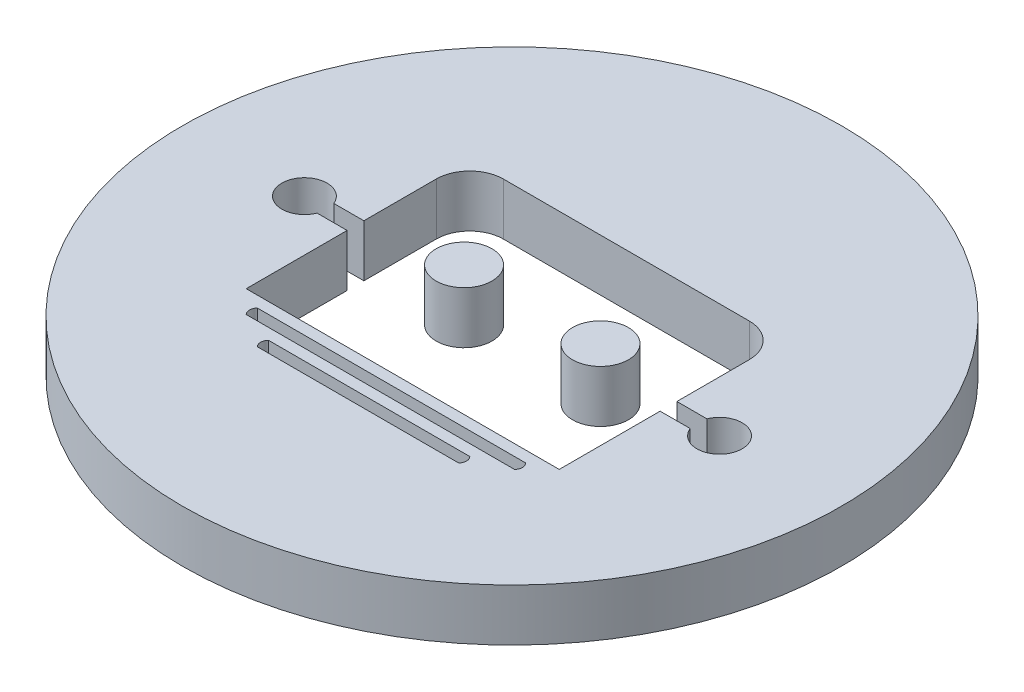
ISO-10303-21;
HEADER;
FILE_DESCRIPTION(('STEP AP214'),'2;1');
FILE_NAME('part.step','',(''),(''),'','','');
FILE_SCHEMA(('AUTOMOTIVE_DESIGN { 1 0 10303 214 1 1 1 1 }'));
ENDSEC;
DATA;
#1=APPLICATION_CONTEXT('core data for automotive mechanical design processes');
#2=APPLICATION_PROTOCOL_DEFINITION('international standard','automotive_design',2000,#1);
#3=PRODUCT_CONTEXT('',#1,'mechanical');
#4=PRODUCT('Part','Part','',(#3));
#5=PRODUCT_RELATED_PRODUCT_CATEGORY('part','',(#4));
#6=PRODUCT_DEFINITION_FORMATION('','',#4);
#7=PRODUCT_DEFINITION_CONTEXT('part definition',#1,'design');
#8=PRODUCT_DEFINITION('design','',#6,#7);
#9=PRODUCT_DEFINITION_SHAPE('','',#8);
#10=(LENGTH_UNIT() NAMED_UNIT(*) SI_UNIT(.MILLI.,.METRE.));
#11=(NAMED_UNIT(*) PLANE_ANGLE_UNIT() SI_UNIT($,.RADIAN.));
#12=(NAMED_UNIT(*) SI_UNIT($,.STERADIAN.) SOLID_ANGLE_UNIT());
#13=UNCERTAINTY_MEASURE_WITH_UNIT(LENGTH_MEASURE(1.E-05),#10,'distance_accuracy_value','');
#14=(GEOMETRIC_REPRESENTATION_CONTEXT(3) GLOBAL_UNCERTAINTY_ASSIGNED_CONTEXT((#13)) GLOBAL_UNIT_ASSIGNED_CONTEXT((#10,
#11,#12)) REPRESENTATION_CONTEXT('',''));
#15=CARTESIAN_POINT('',(0.,0.,0.));
#16=DIRECTION('',(0.,0.,1.));
#17=DIRECTION('',(1.,0.,0.));
#18=AXIS2_PLACEMENT_3D('',#15,#16,#17);
#19=CARTESIAN_POINT('',(-35.6565223605691,3.,-86.8647060918394));
#20=DIRECTION('',(0.,-1.,0.));
#21=DIRECTION('',(0.,0.,-1.));
#22=AXIS2_PLACEMENT_3D('',#19,#20,#21);
#23=CYLINDRICAL_SURFACE('',#22,19.);
#24=CARTESIAN_POINT('',(-35.6565223605691,3.,-86.8647060918394));
#25=DIRECTION('',(0.,1.,0.));
#26=DIRECTION('',(0.,0.,1.));
#27=AXIS2_PLACEMENT_3D('',#24,#25,#26);
#28=CIRCLE('',#27,19.);
#29=CARTESIAN_POINT('',(-35.6565223605691,3.,-67.8647060918394));
#30=VERTEX_POINT('',#29);
#31=EDGE_CURVE('E264',#30,#30,#28,.T.);
#32=ORIENTED_EDGE('',*,*,#31,.F.);
#33=EDGE_LOOP('',(#32));
#34=FACE_BOUND('',#33,.T.);
#35=CARTESIAN_POINT('',(-35.6565223605691,0.,-86.8647060918394));
#36=DIRECTION('',(0.,1.,0.));
#37=DIRECTION('',(0.,0.,1.));
#38=AXIS2_PLACEMENT_3D('',#35,#36,#37);
#39=CIRCLE('',#38,19.);
#40=CARTESIAN_POINT('',(-35.6565223605691,0.,-67.8647060918394));
#41=VERTEX_POINT('',#40);
#42=EDGE_CURVE('E255',#41,#41,#39,.T.);
#43=ORIENTED_EDGE('',*,*,#42,.T.);
#44=EDGE_LOOP('',(#43));
#45=FACE_BOUND('',#44,.T.);
#46=ADVANCED_FACE('F42',(#34,#45),#23,.T.);
#47=CARTESIAN_POINT('',(-35.6565223605691,3.,-86.8647060918394));
#48=DIRECTION('',(0.,1.,0.));
#49=DIRECTION('',(0.,0.,1.));
#50=AXIS2_PLACEMENT_3D('',#47,#48,#49);
#51=PLANE('',#50);
#52=CARTESIAN_POINT('',(-41.1347905407077,3.,-78.3085075817985));
#53=DIRECTION('',(0.,1.,0.));
#54=DIRECTION('',(0.,0.,1.));
#55=AXIS2_PLACEMENT_3D('',#52,#53,#54);
#56=CIRCLE('',#55,0.45573183286289);
#57=CARTESIAN_POINT('',(-41.4570416101277,3.,-78.6307586512184));
#58=VERTEX_POINT('',#57);
#59=CARTESIAN_POINT('',(-41.4570416101277,3.,-77.9862565123785));
#60=VERTEX_POINT('',#59);
#61=EDGE_CURVE('E59',#58,#60,#56,.T.);
#62=ORIENTED_EDGE('',*,*,#61,.F.);
#63=DIRECTION('',(-1.,0.,0.));
#64=VECTOR('',#63,1.);
#65=CARTESIAN_POINT('',(-41.4570416101277,3.,-78.6307586512184));
#66=LINE('',#65,#64);
#67=CARTESIAN_POINT('',(-29.8560031110105,3.,-78.6307586512184));
#68=VERTEX_POINT('',#67);
#69=EDGE_CURVE('E211',#68,#58,#66,.T.);
#70=ORIENTED_EDGE('',*,*,#69,.F.);
#71=CARTESIAN_POINT('',(-30.1782541804304,3.,-78.3085075817985));
#72=DIRECTION('',(0.,1.,0.));
#73=DIRECTION('',(0.,0.,-1.));
#74=AXIS2_PLACEMENT_3D('',#71,#72,#73);
#75=CIRCLE('',#74,0.45573183286289);
#76=CARTESIAN_POINT('',(-29.8560031110105,3.,-77.9862565123785));
#77=VERTEX_POINT('',#76);
#78=EDGE_CURVE('E214',#77,#68,#75,.T.);
#79=ORIENTED_EDGE('',*,*,#78,.F.);
#80=DIRECTION('',(1.,0.,0.));
#81=VECTOR('',#80,1.);
#82=CARTESIAN_POINT('',(-41.4570416101277,3.,-77.9862565123785));
#83=LINE('',#82,#81);
#84=EDGE_CURVE('E220',#60,#77,#83,.T.);
#85=ORIENTED_EDGE('',*,*,#84,.F.);
#86=EDGE_LOOP('',(#62,#70,#79,#85));
#87=FACE_BOUND('',#86,.T.);
#88=CARTESIAN_POINT('',(-43.0682969572273,3.,-79.5975118594782));
#89=DIRECTION('',(0.,1.,0.));
#90=DIRECTION('',(0.,0.,1.));
#91=AXIS2_PLACEMENT_3D('',#88,#89,#90);
#92=CIRCLE('',#91,0.455731832862915);
#93=CARTESIAN_POINT('',(-43.3905480266472,3.,-79.9197629288981));
#94=VERTEX_POINT('',#93);
#95=CARTESIAN_POINT('',(-43.3905480266472,3.,-79.2752607900582));
#96=VERTEX_POINT('',#95);
#97=EDGE_CURVE('E226',#94,#96,#92,.T.);
#98=ORIENTED_EDGE('',*,*,#97,.F.);
#99=DIRECTION('',(-1.,0.,0.));
#100=VECTOR('',#99,1.);
#101=CARTESIAN_POINT('',(-43.3905480266472,3.,-79.9197629288981));
#102=LINE('',#101,#100);
#103=CARTESIAN_POINT('',(-27.9224966944909,3.,-79.9197629288981));
#104=VERTEX_POINT('',#103);
#105=EDGE_CURVE('E234',#104,#94,#102,.T.);
#106=ORIENTED_EDGE('',*,*,#105,.F.);
#107=CARTESIAN_POINT('',(-28.2447477639109,3.,-79.5975118594782));
#108=DIRECTION('',(0.,1.,0.));
#109=DIRECTION('',(0.,0.,-1.));
#110=AXIS2_PLACEMENT_3D('',#107,#108,#109);
#111=CIRCLE('',#110,0.45573183286291);
#112=CARTESIAN_POINT('',(-27.9224966944909,3.,-79.2752607900582));
#113=VERTEX_POINT('',#112);
#114=EDGE_CURVE('E248',#113,#104,#111,.T.);
#115=ORIENTED_EDGE('',*,*,#114,.F.);
#116=DIRECTION('',(1.,0.,0.));
#117=VECTOR('',#116,1.);
#118=CARTESIAN_POINT('',(-43.3905480266472,3.,-79.2752607900582));
#119=LINE('',#118,#117);
#120=EDGE_CURVE('E245',#96,#113,#119,.T.);
#121=ORIENTED_EDGE('',*,*,#120,.F.);
#122=EDGE_LOOP('',(#98,#106,#115,#121));
#123=FACE_BOUND('',#122,.T.);
#124=DIRECTION('',(1.,0.,0.));
#125=VECTOR('',#124,1.);
#126=CARTESIAN_POINT('',(-26.6334924168112,3.,-80.5642650677379));
#127=LINE('',#126,#125);
#128=CARTESIAN_POINT('',(-44.6795523043269,3.,-80.5642650677379));
#129=VERTEX_POINT('',#128);
#130=CARTESIAN_POINT('',(-26.6334924168112,3.,-80.5642650677379));
#131=VERTEX_POINT('',#130);
#132=EDGE_CURVE('E306',#129,#131,#127,.T.);
#133=ORIENTED_EDGE('',*,*,#132,.F.);
#134=DIRECTION('',(0.,0.,1.));
#135=VECTOR('',#134,1.);
#136=CARTESIAN_POINT('',(-44.6795523043269,3.,-80.5642650677379));
#137=LINE('',#136,#135);
#138=CARTESIAN_POINT('',(-44.6795523043269,3.,-86.3813294877095));
#139=VERTEX_POINT('',#138);
#140=EDGE_CURVE('E303',#139,#129,#137,.T.);
#141=ORIENTED_EDGE('',*,*,#140,.F.);
#142=DIRECTION('',(1.,0.,0.));
#143=VECTOR('',#142,1.);
#144=CARTESIAN_POINT('',(-44.6795523043269,3.,-86.3813294877095));
#145=LINE('',#144,#143);
#146=CARTESIAN_POINT('',(-46.4121857606302,3.,-86.3813294877095));
#147=VERTEX_POINT('',#146);
#148=EDGE_CURVE('E300',#147,#139,#145,.T.);
#149=ORIENTED_EDGE('',*,*,#148,.F.);
#150=CARTESIAN_POINT('',(-47.6224304451511,3.,-86.8647060918394));
#151=DIRECTION('',(0.,1.,0.));
#152=DIRECTION('',(0.,0.,1.));
#153=AXIS2_PLACEMENT_3D('',#150,#151,#152);
#154=CIRCLE('',#153,1.30320571585279);
#155=CARTESIAN_POINT('',(-46.4121857606302,3.,-87.3480826959693));
#156=VERTEX_POINT('',#155);
#157=EDGE_CURVE('E297',#156,#147,#154,.T.);
#158=ORIENTED_EDGE('',*,*,#157,.F.);
#159=DIRECTION('',(-1.,0.,0.));
#160=VECTOR('',#159,1.);
#161=CARTESIAN_POINT('',(-46.4121857606302,3.,-87.3480826959693));
#162=LINE('',#161,#160);
#163=CARTESIAN_POINT('',(-44.6795523043269,3.,-87.3480826959693));
#164=VERTEX_POINT('',#163);
#165=EDGE_CURVE('E294',#164,#156,#162,.T.);
#166=ORIENTED_EDGE('',*,*,#165,.F.);
#167=DIRECTION('',(0.,0.,1.));
#168=VECTOR('',#167,1.);
#169=CARTESIAN_POINT('',(-44.6795523043269,3.,-87.3480826959693));
#170=LINE('',#169,#168);
#171=CARTESIAN_POINT('',(-44.6795523043269,3.,-91.5208014280153));
#172=VERTEX_POINT('',#171);
#173=EDGE_CURVE('E291',#172,#164,#170,.T.);
#174=ORIENTED_EDGE('',*,*,#173,.F.);
#175=CARTESIAN_POINT('',(-42.7460458878074,3.,-91.5208014280153));
#176=DIRECTION('',(0.,1.,0.));
#177=DIRECTION('',(0.,0.,1.));
#178=AXIS2_PLACEMENT_3D('',#175,#176,#177);
#179=CIRCLE('',#178,1.93350641651953);
#180=CARTESIAN_POINT('',(-42.7460458878074,3.,-93.4543078445348));
#181=VERTEX_POINT('',#180);
#182=EDGE_CURVE('E288',#181,#172,#179,.T.);
#183=ORIENTED_EDGE('',*,*,#182,.F.);
#184=DIRECTION('',(-1.,0.,0.));
#185=VECTOR('',#184,1.);
#186=CARTESIAN_POINT('',(-42.7460458878074,3.,-93.4543078445348));
#187=LINE('',#186,#185);
#188=CARTESIAN_POINT('',(-28.5669988333308,3.,-93.4543078445348));
#189=VERTEX_POINT('',#188);
#190=EDGE_CURVE('E285',#189,#181,#187,.T.);
#191=ORIENTED_EDGE('',*,*,#190,.F.);
#192=CARTESIAN_POINT('',(-28.5669988333308,3.,-91.5208014280153));
#193=DIRECTION('',(0.,1.,0.));
#194=DIRECTION('',(0.,0.,1.));
#195=AXIS2_PLACEMENT_3D('',#192,#193,#194);
#196=CIRCLE('',#195,1.93350641651954);
#197=CARTESIAN_POINT('',(-26.6334924168112,3.,-91.5208014280153));
#198=VERTEX_POINT('',#197);
#199=EDGE_CURVE('E282',#198,#189,#196,.T.);
#200=ORIENTED_EDGE('',*,*,#199,.F.);
#201=DIRECTION('',(0.,0.,-1.));
#202=VECTOR('',#201,1.);
#203=CARTESIAN_POINT('',(-26.6334924168112,3.,-91.5208014280153));
#204=LINE('',#203,#202);
#205=CARTESIAN_POINT('',(-26.6334924168112,3.,-87.3480826959693));
#206=VERTEX_POINT('',#205);
#207=EDGE_CURVE('E279',#206,#198,#204,.T.);
#208=ORIENTED_EDGE('',*,*,#207,.F.);
#209=DIRECTION('',(-1.,0.,0.));
#210=VECTOR('',#209,1.);
#211=CARTESIAN_POINT('',(-26.6334924168112,3.,-87.3480826959693));
#212=LINE('',#211,#210);
#213=CARTESIAN_POINT('',(-24.9008589605079,3.,-87.3480826959693));
#214=VERTEX_POINT('',#213);
#215=EDGE_CURVE('E276',#214,#206,#212,.T.);
#216=ORIENTED_EDGE('',*,*,#215,.F.);
#217=CARTESIAN_POINT('',(-23.690614275987,3.,-86.8647060918394));
#218=DIRECTION('',(0.,1.,0.));
#219=DIRECTION('',(0.,0.,1.));
#220=AXIS2_PLACEMENT_3D('',#217,#218,#219);
#221=CIRCLE('',#220,1.30320571585279);
#222=CARTESIAN_POINT('',(-24.9008589605079,3.,-86.3813294877095));
#223=VERTEX_POINT('',#222);
#224=EDGE_CURVE('E273',#223,#214,#221,.T.);
#225=ORIENTED_EDGE('',*,*,#224,.F.);
#226=DIRECTION('',(1.,0.,0.));
#227=VECTOR('',#226,1.);
#228=CARTESIAN_POINT('',(-24.9008589605079,3.,-86.3813294877095));
#229=LINE('',#228,#227);
#230=CARTESIAN_POINT('',(-26.6334924168112,3.,-86.3813294877095));
#231=VERTEX_POINT('',#230);
#232=EDGE_CURVE('E270',#231,#223,#229,.T.);
#233=ORIENTED_EDGE('',*,*,#232,.F.);
#234=DIRECTION('',(0.,0.,-1.));
#235=VECTOR('',#234,1.);
#236=CARTESIAN_POINT('',(-26.6334924168112,3.,-86.3813294877095));
#237=LINE('',#236,#235);
#238=EDGE_CURVE('E51',#131,#231,#237,.T.);
#239=ORIENTED_EDGE('',*,*,#238,.F.);
#240=EDGE_LOOP('',(#133,#141,#149,#158,#166,#174,#183,#191,#200,#208,#216,#225,#233,#239));
#241=FACE_BOUND('',#240,.T.);
#242=ORIENTED_EDGE('',*,*,#31,.T.);
#243=EDGE_LOOP('',(#242));
#244=FACE_BOUND('',#243,.T.);
#245=ADVANCED_FACE('F44',(#87,#123,#241,#244),#51,.T.);
#246=CARTESIAN_POINT('',(-35.6565223605691,0.,-86.8647060918394));
#247=DIRECTION('',(0.,1.,0.));
#248=DIRECTION('',(0.,0.,1.));
#249=AXIS2_PLACEMENT_3D('',#246,#247,#248);
#250=PLANE('',#249);
#251=DIRECTION('',(-1.,0.,0.));
#252=VECTOR('',#251,1.);
#253=CARTESIAN_POINT('',(-41.4570416101277,0.,-78.6307586512184));
#254=LINE('',#253,#252);
#255=CARTESIAN_POINT('',(-29.8560031110105,0.,-78.6307586512184));
#256=VERTEX_POINT('',#255);
#257=CARTESIAN_POINT('',(-41.4570416101277,0.,-78.6307586512184));
#258=VERTEX_POINT('',#257);
#259=EDGE_CURVE('E201',#256,#258,#254,.T.);
#260=ORIENTED_EDGE('',*,*,#259,.T.);
#261=CARTESIAN_POINT('',(-41.1347905407077,0.,-78.3085075817985));
#262=DIRECTION('',(0.,1.,0.));
#263=DIRECTION('',(0.,0.,1.));
#264=AXIS2_PLACEMENT_3D('',#261,#262,#263);
#265=CIRCLE('',#264,0.45573183286289);
#266=CARTESIAN_POINT('',(-41.4570416101277,0.,-77.9862565123785));
#267=VERTEX_POINT('',#266);
#268=EDGE_CURVE('E195',#258,#267,#265,.T.);
#269=ORIENTED_EDGE('',*,*,#268,.T.);
#270=DIRECTION('',(1.,0.,0.));
#271=VECTOR('',#270,1.);
#272=CARTESIAN_POINT('',(-41.4570416101277,0.,-77.9862565123785));
#273=LINE('',#272,#271);
#274=CARTESIAN_POINT('',(-29.8560031110105,0.,-77.9862565123785));
#275=VERTEX_POINT('',#274);
#276=EDGE_CURVE('E204',#267,#275,#273,.T.);
#277=ORIENTED_EDGE('',*,*,#276,.T.);
#278=CARTESIAN_POINT('',(-30.1782541804304,0.,-78.3085075817985));
#279=DIRECTION('',(0.,1.,0.));
#280=DIRECTION('',(0.,0.,-1.));
#281=AXIS2_PLACEMENT_3D('',#278,#279,#280);
#282=CIRCLE('',#281,0.45573183286289);
#283=EDGE_CURVE('E67',#275,#256,#282,.T.);
#284=ORIENTED_EDGE('',*,*,#283,.T.);
#285=EDGE_LOOP('',(#260,#269,#277,#284));
#286=FACE_BOUND('',#285,.T.);
#287=DIRECTION('',(-1.,0.,0.));
#288=VECTOR('',#287,1.);
#289=CARTESIAN_POINT('',(-43.3905480266472,0.,-79.9197629288981));
#290=LINE('',#289,#288);
#291=CARTESIAN_POINT('',(-27.9224966944909,0.,-79.9197629288981));
#292=VERTEX_POINT('',#291);
#293=CARTESIAN_POINT('',(-43.3905480266472,0.,-79.9197629288981));
#294=VERTEX_POINT('',#293);
#295=EDGE_CURVE('E240',#292,#294,#290,.T.);
#296=ORIENTED_EDGE('',*,*,#295,.T.);
#297=CARTESIAN_POINT('',(-43.0682969572273,0.,-79.5975118594782));
#298=DIRECTION('',(0.,1.,0.));
#299=DIRECTION('',(0.,0.,1.));
#300=AXIS2_PLACEMENT_3D('',#297,#298,#299);
#301=CIRCLE('',#300,0.455731832862915);
#302=CARTESIAN_POINT('',(-43.3905480266472,0.,-79.2752607900582));
#303=VERTEX_POINT('',#302);
#304=EDGE_CURVE('E230',#294,#303,#301,.T.);
#305=ORIENTED_EDGE('',*,*,#304,.T.);
#306=DIRECTION('',(1.,0.,0.));
#307=VECTOR('',#306,1.);
#308=CARTESIAN_POINT('',(-43.3905480266472,0.,-79.2752607900582));
#309=LINE('',#308,#307);
#310=CARTESIAN_POINT('',(-27.9224966944909,0.,-79.2752607900582));
#311=VERTEX_POINT('',#310);
#312=EDGE_CURVE('E233',#303,#311,#309,.T.);
#313=ORIENTED_EDGE('',*,*,#312,.T.);
#314=CARTESIAN_POINT('',(-28.2447477639109,0.,-79.5975118594782));
#315=DIRECTION('',(0.,1.,0.));
#316=DIRECTION('',(0.,0.,-1.));
#317=AXIS2_PLACEMENT_3D('',#314,#315,#316);
#318=CIRCLE('',#317,0.45573183286291);
#319=EDGE_CURVE('E237',#311,#292,#318,.T.);
#320=ORIENTED_EDGE('',*,*,#319,.T.);
#321=EDGE_LOOP('',(#296,#305,#313,#320));
#322=FACE_BOUND('',#321,.T.);
#323=DIRECTION('',(0.,0.,1.));
#324=VECTOR('',#323,1.);
#325=CARTESIAN_POINT('',(-44.6795523043269,0.,-80.5642650677379));
#326=LINE('',#325,#324);
#327=CARTESIAN_POINT('',(-44.6795523043269,0.,-86.3813294877095));
#328=VERTEX_POINT('',#327);
#329=CARTESIAN_POINT('',(-44.6795523043269,0.,-80.5642650677379));
#330=VERTEX_POINT('',#329);
#331=EDGE_CURVE('E266',#328,#330,#326,.T.);
#332=ORIENTED_EDGE('',*,*,#331,.T.);
#333=DIRECTION('',(1.,0.,0.));
#334=VECTOR('',#333,1.);
#335=CARTESIAN_POINT('',(-26.6334924168112,0.,-80.5642650677379));
#336=LINE('',#335,#334);
#337=CARTESIAN_POINT('',(-26.6334924168112,0.,-80.5642650677379));
#338=VERTEX_POINT('',#337);
#339=EDGE_CURVE('E46',#330,#338,#336,.T.);
#340=ORIENTED_EDGE('',*,*,#339,.T.);
#341=DIRECTION('',(0.,0.,-1.));
#342=VECTOR('',#341,1.);
#343=CARTESIAN_POINT('',(-26.6334924168112,0.,-86.3813294877095));
#344=LINE('',#343,#342);
#345=CARTESIAN_POINT('',(-26.6334924168112,0.,-86.3813294877095));
#346=VERTEX_POINT('',#345);
#347=EDGE_CURVE('E368',#338,#346,#344,.T.);
#348=ORIENTED_EDGE('',*,*,#347,.T.);
#349=DIRECTION('',(1.,0.,0.));
#350=VECTOR('',#349,1.);
#351=CARTESIAN_POINT('',(-24.9008589605079,0.,-86.3813294877095));
#352=LINE('',#351,#350);
#353=CARTESIAN_POINT('',(-24.9008589605079,0.,-86.3813294877095));
#354=VERTEX_POINT('',#353);
#355=EDGE_CURVE('E366',#346,#354,#352,.T.);
#356=ORIENTED_EDGE('',*,*,#355,.T.);
#357=CARTESIAN_POINT('',(-23.690614275987,0.,-86.8647060918394));
#358=DIRECTION('',(0.,1.,0.));
#359=DIRECTION('',(0.,0.,1.));
#360=AXIS2_PLACEMENT_3D('',#357,#358,#359);
#361=CIRCLE('',#360,1.30320571585279);
#362=CARTESIAN_POINT('',(-24.9008589605079,0.,-87.3480826959693));
#363=VERTEX_POINT('',#362);
#364=EDGE_CURVE('E363',#354,#363,#361,.T.);
#365=ORIENTED_EDGE('',*,*,#364,.T.);
#366=DIRECTION('',(-1.,0.,0.));
#367=VECTOR('',#366,1.);
#368=CARTESIAN_POINT('',(-26.6334924168112,0.,-87.3480826959693));
#369=LINE('',#368,#367);
#370=CARTESIAN_POINT('',(-26.6334924168112,0.,-87.3480826959693));
#371=VERTEX_POINT('',#370);
#372=EDGE_CURVE('E360',#363,#371,#369,.T.);
#373=ORIENTED_EDGE('',*,*,#372,.T.);
#374=DIRECTION('',(0.,0.,-1.));
#375=VECTOR('',#374,1.);
#376=CARTESIAN_POINT('',(-26.6334924168112,0.,-91.5208014280153));
#377=LINE('',#376,#375);
#378=CARTESIAN_POINT('',(-26.6334924168112,0.,-91.5208014280153));
#379=VERTEX_POINT('',#378);
#380=EDGE_CURVE('E357',#371,#379,#377,.T.);
#381=ORIENTED_EDGE('',*,*,#380,.T.);
#382=CARTESIAN_POINT('',(-28.5669988333308,0.,-91.5208014280153));
#383=DIRECTION('',(0.,1.,0.));
#384=DIRECTION('',(0.,0.,1.));
#385=AXIS2_PLACEMENT_3D('',#382,#383,#384);
#386=CIRCLE('',#385,1.93350641651954);
#387=CARTESIAN_POINT('',(-28.5669988333308,0.,-93.4543078445348));
#388=VERTEX_POINT('',#387);
#389=EDGE_CURVE('E354',#379,#388,#386,.T.);
#390=ORIENTED_EDGE('',*,*,#389,.T.);
#391=DIRECTION('',(-1.,0.,0.));
#392=VECTOR('',#391,1.);
#393=CARTESIAN_POINT('',(-42.7460458878074,0.,-93.4543078445348));
#394=LINE('',#393,#392);
#395=CARTESIAN_POINT('',(-42.7460458878074,0.,-93.4543078445348));
#396=VERTEX_POINT('',#395);
#397=EDGE_CURVE('E351',#388,#396,#394,.T.);
#398=ORIENTED_EDGE('',*,*,#397,.T.);
#399=CARTESIAN_POINT('',(-42.7460458878074,0.,-91.5208014280153));
#400=DIRECTION('',(0.,1.,0.));
#401=DIRECTION('',(0.,0.,1.));
#402=AXIS2_PLACEMENT_3D('',#399,#400,#401);
#403=CIRCLE('',#402,1.93350641651953);
#404=CARTESIAN_POINT('',(-44.6795523043269,0.,-91.5208014280153));
#405=VERTEX_POINT('',#404);
#406=EDGE_CURVE('E348',#396,#405,#403,.T.);
#407=ORIENTED_EDGE('',*,*,#406,.T.);
#408=DIRECTION('',(0.,0.,1.));
#409=VECTOR('',#408,1.);
#410=CARTESIAN_POINT('',(-44.6795523043269,0.,-87.3480826959693));
#411=LINE('',#410,#409);
#412=CARTESIAN_POINT('',(-44.6795523043269,0.,-87.3480826959693));
#413=VERTEX_POINT('',#412);
#414=EDGE_CURVE('E345',#405,#413,#411,.T.);
#415=ORIENTED_EDGE('',*,*,#414,.T.);
#416=DIRECTION('',(-1.,0.,0.));
#417=VECTOR('',#416,1.);
#418=CARTESIAN_POINT('',(-46.4121857606302,0.,-87.3480826959693));
#419=LINE('',#418,#417);
#420=CARTESIAN_POINT('',(-46.4121857606302,0.,-87.3480826959693));
#421=VERTEX_POINT('',#420);
#422=EDGE_CURVE('E342',#413,#421,#419,.T.);
#423=ORIENTED_EDGE('',*,*,#422,.T.);
#424=CARTESIAN_POINT('',(-47.6224304451511,0.,-86.8647060918394));
#425=DIRECTION('',(0.,1.,0.));
#426=DIRECTION('',(0.,0.,1.));
#427=AXIS2_PLACEMENT_3D('',#424,#425,#426);
#428=CIRCLE('',#427,1.30320571585279);
#429=CARTESIAN_POINT('',(-46.4121857606302,0.,-86.3813294877095));
#430=VERTEX_POINT('',#429);
#431=EDGE_CURVE('E339',#421,#430,#428,.T.);
#432=ORIENTED_EDGE('',*,*,#431,.T.);
#433=DIRECTION('',(1.,0.,0.));
#434=VECTOR('',#433,1.);
#435=CARTESIAN_POINT('',(-44.6795523043269,0.,-86.3813294877095));
#436=LINE('',#435,#434);
#437=EDGE_CURVE('E334',#430,#328,#436,.T.);
#438=ORIENTED_EDGE('',*,*,#437,.T.);
#439=EDGE_LOOP('',(#332,#340,#348,#356,#365,#373,#381,#390,#398,#407,#415,#423,#432,#438));
#440=FACE_BOUND('',#439,.T.);
#441=ORIENTED_EDGE('',*,*,#42,.F.);
#442=EDGE_LOOP('',(#441));
#443=FACE_BOUND('',#442,.T.);
#444=ADVANCED_FACE('F208',(#286,#322,#440,#443),#250,.F.);
#445=CARTESIAN_POINT('',(-26.6334924168112,0.,-80.5642650677379));
#446=DIRECTION('',(0.,0.,1.));
#447=DIRECTION('',(1.,0.,0.));
#448=AXIS2_PLACEMENT_3D('',#445,#446,#447);
#449=PLANE('',#448);
#450=ORIENTED_EDGE('',*,*,#132,.T.);
#451=DIRECTION('',(0.,1.,0.));
#452=VECTOR('',#451,1.);
#453=CARTESIAN_POINT('',(-26.6334924168112,0.,-80.5642650677379));
#454=LINE('',#453,#452);
#455=EDGE_CURVE('E12',#338,#131,#454,.T.);
#456=ORIENTED_EDGE('',*,*,#455,.F.);
#457=ORIENTED_EDGE('',*,*,#339,.F.);
#458=DIRECTION('',(0.,1.,0.));
#459=VECTOR('',#458,1.);
#460=CARTESIAN_POINT('',(-44.6795523043269,0.,-80.5642650677379));
#461=LINE('',#460,#459);
#462=EDGE_CURVE('E304',#330,#129,#461,.T.);
#463=ORIENTED_EDGE('',*,*,#462,.T.);
#464=EDGE_LOOP('',(#450,#456,#457,#463));
#465=FACE_BOUND('',#464,.T.);
#466=ADVANCED_FACE('F377',(#465),#449,.F.);
#467=CARTESIAN_POINT('',(-44.6795523043269,0.,-80.5642650677379));
#468=DIRECTION('',(-1.,0.,0.));
#469=DIRECTION('',(0.,0.,1.));
#470=AXIS2_PLACEMENT_3D('',#467,#468,#469);
#471=PLANE('',#470);
#472=ORIENTED_EDGE('',*,*,#140,.T.);
#473=ORIENTED_EDGE('',*,*,#462,.F.);
#474=ORIENTED_EDGE('',*,*,#331,.F.);
#475=DIRECTION('',(0.,1.,0.));
#476=VECTOR('',#475,1.);
#477=CARTESIAN_POINT('',(-44.6795523043269,0.,-86.3813294877095));
#478=LINE('',#477,#476);
#479=EDGE_CURVE('E301',#328,#139,#478,.T.);
#480=ORIENTED_EDGE('',*,*,#479,.T.);
#481=EDGE_LOOP('',(#472,#473,#474,#480));
#482=FACE_BOUND('',#481,.T.);
#483=ADVANCED_FACE('F428',(#482),#471,.F.);
#484=CARTESIAN_POINT('',(-44.6795523043269,0.,-86.3813294877095));
#485=DIRECTION('',(0.,0.,1.));
#486=DIRECTION('',(1.,0.,0.));
#487=AXIS2_PLACEMENT_3D('',#484,#485,#486);
#488=PLANE('',#487);
#489=ORIENTED_EDGE('',*,*,#148,.T.);
#490=ORIENTED_EDGE('',*,*,#479,.F.);
#491=ORIENTED_EDGE('',*,*,#437,.F.);
#492=DIRECTION('',(0.,1.,0.));
#493=VECTOR('',#492,1.);
#494=CARTESIAN_POINT('',(-46.4121857606302,0.,-86.3813294877095));
#495=LINE('',#494,#493);
#496=EDGE_CURVE('E298',#430,#147,#495,.T.);
#497=ORIENTED_EDGE('',*,*,#496,.T.);
#498=EDGE_LOOP('',(#489,#490,#491,#497));
#499=FACE_BOUND('',#498,.T.);
#500=ADVANCED_FACE('F424',(#499),#488,.F.);
#501=CARTESIAN_POINT('',(-47.6224304451511,0.,-86.8647060918394));
#502=DIRECTION('',(0.,1.,0.));
#503=DIRECTION('',(0.,0.,1.));
#504=AXIS2_PLACEMENT_3D('',#501,#502,#503);
#505=CYLINDRICAL_SURFACE('',#504,1.30320571585279);
#506=ORIENTED_EDGE('',*,*,#157,.T.);
#507=ORIENTED_EDGE('',*,*,#496,.F.);
#508=ORIENTED_EDGE('',*,*,#431,.F.);
#509=DIRECTION('',(0.,1.,0.));
#510=VECTOR('',#509,1.);
#511=CARTESIAN_POINT('',(-46.4121857606302,0.,-87.3480826959693));
#512=LINE('',#511,#510);
#513=EDGE_CURVE('E295',#421,#156,#512,.T.);
#514=ORIENTED_EDGE('',*,*,#513,.T.);
#515=EDGE_LOOP('',(#506,#507,#508,#514));
#516=FACE_BOUND('',#515,.T.);
#517=ADVANCED_FACE('F421',(#516),#505,.F.);
#518=CARTESIAN_POINT('',(-46.4121857606302,0.,-87.3480826959693));
#519=DIRECTION('',(0.,0.,-1.));
#520=DIRECTION('',(-1.,0.,0.));
#521=AXIS2_PLACEMENT_3D('',#518,#519,#520);
#522=PLANE('',#521);
#523=ORIENTED_EDGE('',*,*,#165,.T.);
#524=ORIENTED_EDGE('',*,*,#513,.F.);
#525=ORIENTED_EDGE('',*,*,#422,.F.);
#526=DIRECTION('',(0.,1.,0.));
#527=VECTOR('',#526,1.);
#528=CARTESIAN_POINT('',(-44.6795523043269,0.,-87.3480826959693));
#529=LINE('',#528,#527);
#530=EDGE_CURVE('E292',#413,#164,#529,.T.);
#531=ORIENTED_EDGE('',*,*,#530,.T.);
#532=EDGE_LOOP('',(#523,#524,#525,#531));
#533=FACE_BOUND('',#532,.T.);
#534=ADVANCED_FACE('F417',(#533),#522,.F.);
#535=CARTESIAN_POINT('',(-44.6795523043269,0.,-87.3480826959693));
#536=DIRECTION('',(-1.,0.,0.));
#537=DIRECTION('',(0.,0.,1.));
#538=AXIS2_PLACEMENT_3D('',#535,#536,#537);
#539=PLANE('',#538);
#540=ORIENTED_EDGE('',*,*,#173,.T.);
#541=ORIENTED_EDGE('',*,*,#530,.F.);
#542=ORIENTED_EDGE('',*,*,#414,.F.);
#543=DIRECTION('',(0.,1.,0.));
#544=VECTOR('',#543,1.);
#545=CARTESIAN_POINT('',(-44.6795523043269,0.,-91.5208014280153));
#546=LINE('',#545,#544);
#547=EDGE_CURVE('E289',#405,#172,#546,.T.);
#548=ORIENTED_EDGE('',*,*,#547,.T.);
#549=EDGE_LOOP('',(#540,#541,#542,#548));
#550=FACE_BOUND('',#549,.T.);
#551=ADVANCED_FACE('F413',(#550),#539,.F.);
#552=CARTESIAN_POINT('',(-42.7460458878074,0.,-91.5208014280153));
#553=DIRECTION('',(0.,1.,0.));
#554=DIRECTION('',(0.,0.,1.));
#555=AXIS2_PLACEMENT_3D('',#552,#553,#554);
#556=CYLINDRICAL_SURFACE('',#555,1.93350641651953);
#557=ORIENTED_EDGE('',*,*,#182,.T.);
#558=ORIENTED_EDGE('',*,*,#547,.F.);
#559=ORIENTED_EDGE('',*,*,#406,.F.);
#560=DIRECTION('',(0.,1.,0.));
#561=VECTOR('',#560,1.);
#562=CARTESIAN_POINT('',(-42.7460458878074,0.,-93.4543078445348));
#563=LINE('',#562,#561);
#564=EDGE_CURVE('E286',#396,#181,#563,.T.);
#565=ORIENTED_EDGE('',*,*,#564,.T.);
#566=EDGE_LOOP('',(#557,#558,#559,#565));
#567=FACE_BOUND('',#566,.T.);
#568=ADVANCED_FACE('F409',(#567),#556,.F.);
#569=CARTESIAN_POINT('',(-42.7460458878074,0.,-93.4543078445348));
#570=DIRECTION('',(0.,0.,-1.));
#571=DIRECTION('',(-1.,0.,0.));
#572=AXIS2_PLACEMENT_3D('',#569,#570,#571);
#573=PLANE('',#572);
#574=ORIENTED_EDGE('',*,*,#190,.T.);
#575=ORIENTED_EDGE('',*,*,#564,.F.);
#576=ORIENTED_EDGE('',*,*,#397,.F.);
#577=DIRECTION('',(0.,1.,0.));
#578=VECTOR('',#577,1.);
#579=CARTESIAN_POINT('',(-28.5669988333308,0.,-93.4543078445348));
#580=LINE('',#579,#578);
#581=EDGE_CURVE('E283',#388,#189,#580,.T.);
#582=ORIENTED_EDGE('',*,*,#581,.T.);
#583=EDGE_LOOP('',(#574,#575,#576,#582));
#584=FACE_BOUND('',#583,.T.);
#585=ADVANCED_FACE('F405',(#584),#573,.F.);
#586=CARTESIAN_POINT('',(-28.5669988333308,0.,-91.5208014280153));
#587=DIRECTION('',(0.,1.,0.));
#588=DIRECTION('',(0.,0.,1.));
#589=AXIS2_PLACEMENT_3D('',#586,#587,#588);
#590=CYLINDRICAL_SURFACE('',#589,1.93350641651954);
#591=ORIENTED_EDGE('',*,*,#199,.T.);
#592=ORIENTED_EDGE('',*,*,#581,.F.);
#593=ORIENTED_EDGE('',*,*,#389,.F.);
#594=DIRECTION('',(0.,1.,0.));
#595=VECTOR('',#594,1.);
#596=CARTESIAN_POINT('',(-26.6334924168112,0.,-91.5208014280153));
#597=LINE('',#596,#595);
#598=EDGE_CURVE('E280',#379,#198,#597,.T.);
#599=ORIENTED_EDGE('',*,*,#598,.T.);
#600=EDGE_LOOP('',(#591,#592,#593,#599));
#601=FACE_BOUND('',#600,.T.);
#602=ADVANCED_FACE('F401',(#601),#590,.F.);
#603=CARTESIAN_POINT('',(-26.6334924168112,0.,-91.5208014280153));
#604=DIRECTION('',(1.,0.,0.));
#605=DIRECTION('',(0.,0.,-1.));
#606=AXIS2_PLACEMENT_3D('',#603,#604,#605);
#607=PLANE('',#606);
#608=ORIENTED_EDGE('',*,*,#207,.T.);
#609=ORIENTED_EDGE('',*,*,#598,.F.);
#610=ORIENTED_EDGE('',*,*,#380,.F.);
#611=DIRECTION('',(0.,1.,0.));
#612=VECTOR('',#611,1.);
#613=CARTESIAN_POINT('',(-26.6334924168112,0.,-87.3480826959693));
#614=LINE('',#613,#612);
#615=EDGE_CURVE('E277',#371,#206,#614,.T.);
#616=ORIENTED_EDGE('',*,*,#615,.T.);
#617=EDGE_LOOP('',(#608,#609,#610,#616));
#618=FACE_BOUND('',#617,.T.);
#619=ADVANCED_FACE('F397',(#618),#607,.F.);
#620=CARTESIAN_POINT('',(-26.6334924168112,0.,-87.3480826959693));
#621=DIRECTION('',(0.,0.,-1.));
#622=DIRECTION('',(-1.,0.,0.));
#623=AXIS2_PLACEMENT_3D('',#620,#621,#622);
#624=PLANE('',#623);
#625=ORIENTED_EDGE('',*,*,#215,.T.);
#626=ORIENTED_EDGE('',*,*,#615,.F.);
#627=ORIENTED_EDGE('',*,*,#372,.F.);
#628=DIRECTION('',(0.,1.,0.));
#629=VECTOR('',#628,1.);
#630=CARTESIAN_POINT('',(-24.9008589605079,0.,-87.3480826959693));
#631=LINE('',#630,#629);
#632=EDGE_CURVE('E274',#363,#214,#631,.T.);
#633=ORIENTED_EDGE('',*,*,#632,.T.);
#634=EDGE_LOOP('',(#625,#626,#627,#633));
#635=FACE_BOUND('',#634,.T.);
#636=ADVANCED_FACE('F393',(#635),#624,.F.);
#637=CARTESIAN_POINT('',(-23.690614275987,0.,-86.8647060918394));
#638=DIRECTION('',(0.,1.,0.));
#639=DIRECTION('',(0.,0.,1.));
#640=AXIS2_PLACEMENT_3D('',#637,#638,#639);
#641=CYLINDRICAL_SURFACE('',#640,1.30320571585279);
#642=ORIENTED_EDGE('',*,*,#224,.T.);
#643=ORIENTED_EDGE('',*,*,#632,.F.);
#644=ORIENTED_EDGE('',*,*,#364,.F.);
#645=DIRECTION('',(0.,1.,0.));
#646=VECTOR('',#645,1.);
#647=CARTESIAN_POINT('',(-24.9008589605079,0.,-86.3813294877095));
#648=LINE('',#647,#646);
#649=EDGE_CURVE('E271',#354,#223,#648,.T.);
#650=ORIENTED_EDGE('',*,*,#649,.T.);
#651=EDGE_LOOP('',(#642,#643,#644,#650));
#652=FACE_BOUND('',#651,.T.);
#653=ADVANCED_FACE('F390',(#652),#641,.F.);
#654=CARTESIAN_POINT('',(-24.9008589605079,0.,-86.3813294877095));
#655=DIRECTION('',(0.,0.,1.));
#656=DIRECTION('',(1.,0.,0.));
#657=AXIS2_PLACEMENT_3D('',#654,#655,#656);
#658=PLANE('',#657);
#659=ORIENTED_EDGE('',*,*,#232,.T.);
#660=ORIENTED_EDGE('',*,*,#649,.F.);
#661=ORIENTED_EDGE('',*,*,#355,.F.);
#662=DIRECTION('',(0.,1.,0.));
#663=VECTOR('',#662,1.);
#664=CARTESIAN_POINT('',(-26.6334924168112,0.,-86.3813294877095));
#665=LINE('',#664,#663);
#666=EDGE_CURVE('E268',#346,#231,#665,.T.);
#667=ORIENTED_EDGE('',*,*,#666,.T.);
#668=EDGE_LOOP('',(#659,#660,#661,#667));
#669=FACE_BOUND('',#668,.T.);
#670=ADVANCED_FACE('F385',(#669),#658,.F.);
#671=CARTESIAN_POINT('',(-26.6334924168112,0.,-86.3813294877095));
#672=DIRECTION('',(1.,0.,0.));
#673=DIRECTION('',(0.,0.,-1.));
#674=AXIS2_PLACEMENT_3D('',#671,#672,#673);
#675=PLANE('',#674);
#676=ORIENTED_EDGE('',*,*,#238,.T.);
#677=ORIENTED_EDGE('',*,*,#666,.F.);
#678=ORIENTED_EDGE('',*,*,#347,.F.);
#679=ORIENTED_EDGE('',*,*,#455,.T.);
#680=EDGE_LOOP('',(#676,#677,#678,#679));
#681=FACE_BOUND('',#680,.T.);
#682=ADVANCED_FACE('F382',(#681),#675,.F.);
#683=CARTESIAN_POINT('',(-43.0682969572273,0.,-79.5975118594782));
#684=DIRECTION('',(0.,1.,0.));
#685=DIRECTION('',(0.,0.,1.));
#686=AXIS2_PLACEMENT_3D('',#683,#684,#685);
#687=CYLINDRICAL_SURFACE('',#686,0.455731832862915);
#688=ORIENTED_EDGE('',*,*,#97,.T.);
#689=DIRECTION('',(0.,1.,0.));
#690=VECTOR('',#689,1.);
#691=CARTESIAN_POINT('',(-43.3905480266472,0.,-79.2752607900582));
#692=LINE('',#691,#690);
#693=EDGE_CURVE('E243',#303,#96,#692,.T.);
#694=ORIENTED_EDGE('',*,*,#693,.F.);
#695=ORIENTED_EDGE('',*,*,#304,.F.);
#696=DIRECTION('',(0.,1.,0.));
#697=VECTOR('',#696,1.);
#698=CARTESIAN_POINT('',(-43.3905480266472,0.,-79.9197629288981));
#699=LINE('',#698,#697);
#700=EDGE_CURVE('E253',#294,#94,#699,.T.);
#701=ORIENTED_EDGE('',*,*,#700,.T.);
#702=EDGE_LOOP('',(#688,#694,#695,#701));
#703=FACE_BOUND('',#702,.T.);
#704=ADVANCED_FACE('F470',(#703),#687,.F.);
#705=CARTESIAN_POINT('',(-43.3905480266472,0.,-79.9197629288981));
#706=DIRECTION('',(0.,0.,-1.));
#707=DIRECTION('',(-1.,0.,0.));
#708=AXIS2_PLACEMENT_3D('',#705,#706,#707);
#709=PLANE('',#708);
#710=ORIENTED_EDGE('',*,*,#105,.T.);
#711=ORIENTED_EDGE('',*,*,#700,.F.);
#712=ORIENTED_EDGE('',*,*,#295,.F.);
#713=DIRECTION('',(0.,1.,0.));
#714=VECTOR('',#713,1.);
#715=CARTESIAN_POINT('',(-27.9224966944909,0.,-79.9197629288981));
#716=LINE('',#715,#714);
#717=EDGE_CURVE('E256',#292,#104,#716,.T.);
#718=ORIENTED_EDGE('',*,*,#717,.T.);
#719=EDGE_LOOP('',(#710,#711,#712,#718));
#720=FACE_BOUND('',#719,.T.);
#721=ADVANCED_FACE('F474',(#720),#709,.F.);
#722=CARTESIAN_POINT('',(-28.2447477639109,0.,-79.5975118594782));
#723=DIRECTION('',(0.,1.,0.));
#724=DIRECTION('',(0.,0.,1.));
#725=AXIS2_PLACEMENT_3D('',#722,#723,#724);
#726=CYLINDRICAL_SURFACE('',#725,0.45573183286291);
#727=ORIENTED_EDGE('',*,*,#114,.T.);
#728=ORIENTED_EDGE('',*,*,#717,.F.);
#729=ORIENTED_EDGE('',*,*,#319,.F.);
#730=DIRECTION('',(0.,1.,0.));
#731=VECTOR('',#730,1.);
#732=CARTESIAN_POINT('',(-27.9224966944909,0.,-79.2752607900582));
#733=LINE('',#732,#731);
#734=EDGE_CURVE('E258',#311,#113,#733,.T.);
#735=ORIENTED_EDGE('',*,*,#734,.T.);
#736=EDGE_LOOP('',(#727,#728,#729,#735));
#737=FACE_BOUND('',#736,.T.);
#738=ADVANCED_FACE('F479',(#737),#726,.F.);
#739=CARTESIAN_POINT('',(-43.3905480266472,0.,-79.2752607900582));
#740=DIRECTION('',(0.,0.,1.));
#741=DIRECTION('',(1.,0.,0.));
#742=AXIS2_PLACEMENT_3D('',#739,#740,#741);
#743=PLANE('',#742);
#744=ORIENTED_EDGE('',*,*,#120,.T.);
#745=ORIENTED_EDGE('',*,*,#734,.F.);
#746=ORIENTED_EDGE('',*,*,#312,.F.);
#747=ORIENTED_EDGE('',*,*,#693,.T.);
#748=EDGE_LOOP('',(#744,#745,#746,#747));
#749=FACE_BOUND('',#748,.T.);
#750=ADVANCED_FACE('F476',(#749),#743,.F.);
#751=CARTESIAN_POINT('',(-41.1347905407077,0.,-78.3085075817985));
#752=DIRECTION('',(0.,1.,0.));
#753=DIRECTION('',(0.,0.,1.));
#754=AXIS2_PLACEMENT_3D('',#751,#752,#753);
#755=CYLINDRICAL_SURFACE('',#754,0.45573183286289);
#756=ORIENTED_EDGE('',*,*,#61,.T.);
#757=DIRECTION('',(0.,1.,0.));
#758=VECTOR('',#757,1.);
#759=CARTESIAN_POINT('',(-41.4570416101277,0.,-77.9862565123785));
#760=LINE('',#759,#758);
#761=EDGE_CURVE('E191',#267,#60,#760,.T.);
#762=ORIENTED_EDGE('',*,*,#761,.F.);
#763=ORIENTED_EDGE('',*,*,#268,.F.);
#764=DIRECTION('',(0.,1.,0.));
#765=VECTOR('',#764,1.);
#766=CARTESIAN_POINT('',(-41.4570416101277,0.,-78.6307586512184));
#767=LINE('',#766,#765);
#768=EDGE_CURVE('E224',#258,#58,#767,.T.);
#769=ORIENTED_EDGE('',*,*,#768,.T.);
#770=EDGE_LOOP('',(#756,#762,#763,#769));
#771=FACE_BOUND('',#770,.T.);
#772=ADVANCED_FACE('F193',(#771),#755,.F.);
#773=CARTESIAN_POINT('',(-41.4570416101277,0.,-78.6307586512184));
#774=DIRECTION('',(0.,0.,-1.));
#775=DIRECTION('',(-1.,0.,0.));
#776=AXIS2_PLACEMENT_3D('',#773,#774,#775);
#777=PLANE('',#776);
#778=ORIENTED_EDGE('',*,*,#69,.T.);
#779=ORIENTED_EDGE('',*,*,#768,.F.);
#780=ORIENTED_EDGE('',*,*,#259,.F.);
#781=DIRECTION('',(0.,1.,0.));
#782=VECTOR('',#781,1.);
#783=CARTESIAN_POINT('',(-29.8560031110105,0.,-78.6307586512184));
#784=LINE('',#783,#782);
#785=EDGE_CURVE('E227',#256,#68,#784,.T.);
#786=ORIENTED_EDGE('',*,*,#785,.T.);
#787=EDGE_LOOP('',(#778,#779,#780,#786));
#788=FACE_BOUND('',#787,.T.);
#789=ADVANCED_FACE('F489',(#788),#777,.F.);
#790=CARTESIAN_POINT('',(-30.1782541804304,0.,-78.3085075817985));
#791=DIRECTION('',(0.,1.,0.));
#792=DIRECTION('',(0.,0.,1.));
#793=AXIS2_PLACEMENT_3D('',#790,#791,#792);
#794=CYLINDRICAL_SURFACE('',#793,0.45573183286289);
#795=ORIENTED_EDGE('',*,*,#78,.T.);
#796=ORIENTED_EDGE('',*,*,#785,.F.);
#797=ORIENTED_EDGE('',*,*,#283,.F.);
#798=DIRECTION('',(0.,1.,0.));
#799=VECTOR('',#798,1.);
#800=CARTESIAN_POINT('',(-29.8560031110105,0.,-77.9862565123785));
#801=LINE('',#800,#799);
#802=EDGE_CURVE('E200',#275,#77,#801,.T.);
#803=ORIENTED_EDGE('',*,*,#802,.T.);
#804=EDGE_LOOP('',(#795,#796,#797,#803));
#805=FACE_BOUND('',#804,.T.);
#806=ADVANCED_FACE('F492',(#805),#794,.F.);
#807=CARTESIAN_POINT('',(-41.4570416101277,0.,-77.9862565123785));
#808=DIRECTION('',(0.,0.,1.));
#809=DIRECTION('',(1.,0.,0.));
#810=AXIS2_PLACEMENT_3D('',#807,#808,#809);
#811=PLANE('',#810);
#812=ORIENTED_EDGE('',*,*,#84,.T.);
#813=ORIENTED_EDGE('',*,*,#802,.F.);
#814=ORIENTED_EDGE('',*,*,#276,.F.);
#815=ORIENTED_EDGE('',*,*,#761,.T.);
#816=EDGE_LOOP('',(#812,#813,#814,#815));
#817=FACE_BOUND('',#816,.T.);
#818=ADVANCED_FACE('F205',(#817),#811,.F.);
#819=CLOSED_SHELL('',(#46,#245,#444,#466,#483,#500,#517,#534,#551,#568,#585,#602,#619,#636,#653,
#670,#682,#704,#721,#738,#750,#772,#789,#806,#818));
#820=MANIFOLD_SOLID_BREP('B2',#819);
#821=CARTESIAN_POINT('',(-35.6565223605691,0.,-86.8647060918394));
#822=DIRECTION('',(0.,1.,0.));
#823=DIRECTION('',(0.,0.,1.));
#824=AXIS2_PLACEMENT_3D('',#821,#822,#823);
#825=PLANE('',#824);
#826=CARTESIAN_POINT('',(-31.7246524604709,0.,-88.0326600883949));
#827=DIRECTION('',(0.,1.,0.));
#828=DIRECTION('',(0.,0.,1.));
#829=AXIS2_PLACEMENT_3D('',#826,#827,#828);
#830=CIRCLE('',#829,1.61125534709959);
#831=CARTESIAN_POINT('',(-31.7246524604709,0.,-86.4214047412953));
#832=VERTEX_POINT('',#831);
#833=EDGE_CURVE('E670',#832,#832,#830,.T.);
#834=ORIENTED_EDGE('',*,*,#833,.F.);
#835=EDGE_LOOP('',(#834));
#836=FACE_BOUND('',#835,.T.);
#837=ADVANCED_FACE('F666',(#836),#825,.F.);
#838=CARTESIAN_POINT('',(-31.7246524604709,0.,-88.0326600883949));
#839=DIRECTION('',(0.,1.,0.));
#840=DIRECTION('',(0.,0.,1.));
#841=AXIS2_PLACEMENT_3D('',#838,#839,#840);
#842=CYLINDRICAL_SURFACE('',#841,1.61125534709959);
#843=ORIENTED_EDGE('',*,*,#833,.T.);
#844=EDGE_LOOP('',(#843));
#845=FACE_BOUND('',#844,.T.);
#846=CARTESIAN_POINT('',(-31.7246524604709,3.,-88.0326600883949));
#847=DIRECTION('',(0.,1.,0.));
#848=DIRECTION('',(0.,0.,1.));
#849=AXIS2_PLACEMENT_3D('',#846,#847,#848);
#850=CIRCLE('',#849,1.61125534709959);
#851=CARTESIAN_POINT('',(-31.7246524604709,3.,-86.4214047412953));
#852=VERTEX_POINT('',#851);
#853=EDGE_CURVE('E41',#852,#852,#850,.T.);
#854=ORIENTED_EDGE('',*,*,#853,.F.);
#855=EDGE_LOOP('',(#854));
#856=FACE_BOUND('',#855,.T.);
#857=ADVANCED_FACE('F679',(#845,#856),#842,.T.);
#858=CARTESIAN_POINT('',(-35.6565223605691,3.,-86.8647060918394));
#859=DIRECTION('',(0.,1.,0.));
#860=DIRECTION('',(0.,0.,1.));
#861=AXIS2_PLACEMENT_3D('',#858,#859,#860);
#862=PLANE('',#861);
#863=ORIENTED_EDGE('',*,*,#853,.T.);
#864=EDGE_LOOP('',(#863));
#865=FACE_BOUND('',#864,.T.);
#866=ADVANCED_FACE('F668',(#865),#862,.T.);
#867=CLOSED_SHELL('',(#837,#857,#866));
#868=MANIFOLD_SOLID_BREP('B6',#867);
#869=CARTESIAN_POINT('',(-35.6565223605691,0.,-86.8647060918394));
#870=DIRECTION('',(0.,1.,0.));
#871=DIRECTION('',(0.,0.,1.));
#872=AXIS2_PLACEMENT_3D('',#869,#870,#871);
#873=PLANE('',#872);
#874=CARTESIAN_POINT('',(-39.5883922606672,0.,-88.0326600883949));
#875=DIRECTION('',(0.,1.,0.));
#876=DIRECTION('',(0.,0.,1.));
#877=AXIS2_PLACEMENT_3D('',#874,#875,#876);
#878=CIRCLE('',#877,1.61125534709962);
#879=CARTESIAN_POINT('',(-39.5883922606672,0.,-86.4214047412952));
#880=VERTEX_POINT('',#879);
#881=EDGE_CURVE('E665',#880,#880,#878,.T.);
#882=ORIENTED_EDGE('',*,*,#881,.F.);
#883=EDGE_LOOP('',(#882));
#884=FACE_BOUND('',#883,.T.);
#885=ADVANCED_FACE('F707',(#884),#873,.F.);
#886=CARTESIAN_POINT('',(-39.5883922606672,0.,-88.0326600883949));
#887=DIRECTION('',(0.,1.,0.));
#888=DIRECTION('',(0.,0.,1.));
#889=AXIS2_PLACEMENT_3D('',#886,#887,#888);
#890=CYLINDRICAL_SURFACE('',#889,1.61125534709962);
#891=ORIENTED_EDGE('',*,*,#881,.T.);
#892=EDGE_LOOP('',(#891));
#893=FACE_BOUND('',#892,.T.);
#894=CARTESIAN_POINT('',(-39.5883922606672,3.,-88.0326600883949));
#895=DIRECTION('',(0.,1.,0.));
#896=DIRECTION('',(0.,0.,1.));
#897=AXIS2_PLACEMENT_3D('',#894,#895,#896);
#898=CIRCLE('',#897,1.61125534709962);
#899=CARTESIAN_POINT('',(-39.5883922606672,3.,-86.4214047412952));
#900=VERTEX_POINT('',#899);
#901=EDGE_CURVE('E710',#900,#900,#898,.T.);
#902=ORIENTED_EDGE('',*,*,#901,.F.);
#903=EDGE_LOOP('',(#902));
#904=FACE_BOUND('',#903,.T.);
#905=ADVANCED_FACE('F721',(#893,#904),#890,.T.);
#906=CARTESIAN_POINT('',(-35.6565223605691,3.,-86.8647060918394));
#907=DIRECTION('',(0.,1.,0.));
#908=DIRECTION('',(0.,0.,1.));
#909=AXIS2_PLACEMENT_3D('',#906,#907,#908);
#910=PLANE('',#909);
#911=ORIENTED_EDGE('',*,*,#901,.T.);
#912=EDGE_LOOP('',(#911));
#913=FACE_BOUND('',#912,.T.);
#914=ADVANCED_FACE('F719',(#913),#910,.T.);
#915=CLOSED_SHELL('',(#885,#905,#914));
#916=MANIFOLD_SOLID_BREP('B36',#915);
#917=ADVANCED_BREP_SHAPE_REPRESENTATION('',(#18,#820,#868,#916),#14);
#918=SHAPE_DEFINITION_REPRESENTATION(#9,#917);
ENDSEC;
END-ISO-10303-21;
